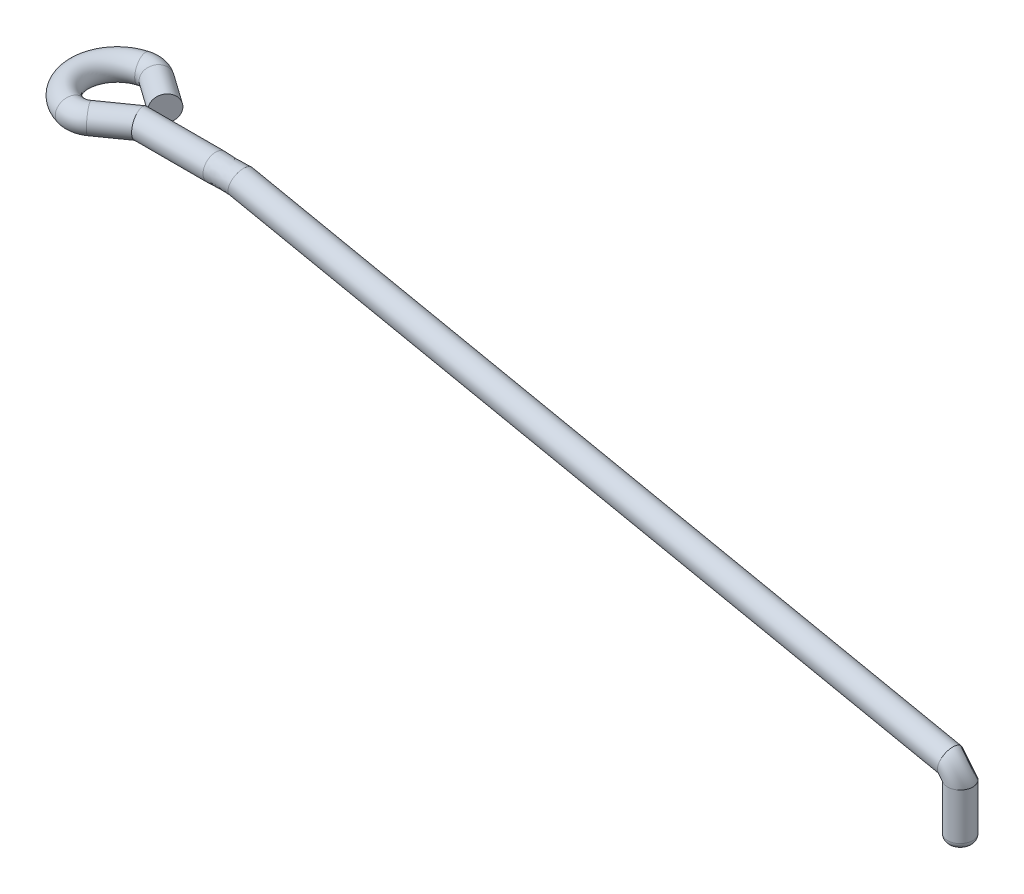
ISO-10303-21;
HEADER;
FILE_DESCRIPTION(('STEP AP214'),'2;1');
FILE_NAME('part.step','',(''),(''),'','','');
FILE_SCHEMA(('AUTOMOTIVE_DESIGN { 1 0 10303 214 1 1 1 1 }'));
ENDSEC;
DATA;
#1=APPLICATION_CONTEXT('core data for automotive mechanical design processes');
#2=APPLICATION_PROTOCOL_DEFINITION('international standard','automotive_design',2000,#1);
#3=PRODUCT_CONTEXT('',#1,'mechanical');
#4=PRODUCT('Part','Part','',(#3));
#5=PRODUCT_RELATED_PRODUCT_CATEGORY('part','',(#4));
#6=PRODUCT_DEFINITION_FORMATION('','',#4);
#7=PRODUCT_DEFINITION_CONTEXT('part definition',#1,'design');
#8=PRODUCT_DEFINITION('design','',#6,#7);
#9=PRODUCT_DEFINITION_SHAPE('','',#8);
#10=(LENGTH_UNIT() NAMED_UNIT(*) SI_UNIT(.MILLI.,.METRE.));
#11=(NAMED_UNIT(*) PLANE_ANGLE_UNIT() SI_UNIT($,.RADIAN.));
#12=(NAMED_UNIT(*) SI_UNIT($,.STERADIAN.) SOLID_ANGLE_UNIT());
#13=UNCERTAINTY_MEASURE_WITH_UNIT(LENGTH_MEASURE(1.E-05),#10,'distance_accuracy_value','');
#14=(GEOMETRIC_REPRESENTATION_CONTEXT(3) GLOBAL_UNCERTAINTY_ASSIGNED_CONTEXT((#13)) GLOBAL_UNIT_ASSIGNED_CONTEXT((#10,
#11,#12)) REPRESENTATION_CONTEXT('',''));
#15=CARTESIAN_POINT('',(0.,0.,0.));
#16=DIRECTION('',(0.,0.,1.));
#17=DIRECTION('',(1.,0.,0.));
#18=AXIS2_PLACEMENT_3D('',#15,#16,#17);
#19=CARTESIAN_POINT('',(1.4142135623731,5.9,-1.));
#20=DIRECTION('',(0.816496580927726,0.,0.577350269189625));
#21=DIRECTION('',(0.577350269189625,0.,-0.816496580927726));
#22=AXIS2_PLACEMENT_3D('',#19,#20,#21);
#23=PLANE('',#22);
#24=CARTESIAN_POINT('',(1.4142135623731,5.9,-1.));
#25=DIRECTION('',(0.816496580927726,0.,0.577350269189625));
#26=DIRECTION('',(0.577350269189625,0.,-0.816496580927726));
#27=AXIS2_PLACEMENT_3D('',#24,#25,#26);
#28=CIRCLE('',#27,0.5);
#29=CARTESIAN_POINT('',(1.70288869696791,5.9,-1.40824829046386));
#30=VERTEX_POINT('',#29);
#31=EDGE_CURVE('E197',#30,#30,#28,.T.);
#32=ORIENTED_EDGE('',*,*,#31,.T.);
#33=EDGE_LOOP('',(#32));
#34=FACE_BOUND('',#33,.T.);
#35=ADVANCED_FACE('F81',(#34),#23,.T.);
#36=CARTESIAN_POINT('',(1.13940307751542,5.9,0.));
#37=DIRECTION('',(1.,0.,0.));
#38=DIRECTION('',(0.,0.,-1.));
#39=AXIS2_PLACEMENT_3D('',#36,#37,#38);
#40=CYLINDRICAL_SURFACE('',#39,0.5);
#41=CARTESIAN_POINT('',(1.4142135623731,5.9,0.));
#42=DIRECTION('',(0.953020613871422,0.,-0.302905446527686));
#43=DIRECTION('',(-0.302905446527686,0.,-0.953020613871423));
#44=AXIS2_PLACEMENT_3D('',#41,#42,#43);
#45=ELLIPSE('',#44,0.52464762327529,0.5);
#46=CARTESIAN_POINT('',(1.2552949397752,5.9,-0.5));
#47=VERTEX_POINT('',#46);
#48=EDGE_CURVE('E160',#47,#47,#45,.T.);
#49=ORIENTED_EDGE('',*,*,#48,.T.);
#50=EDGE_LOOP('',(#49));
#51=FACE_BOUND('',#50,.T.);
#52=CARTESIAN_POINT('',(4.41406825310903,5.89999794507932,-0.499999999995777));
#53=CARTESIAN_POINT('',(4.41385680432195,5.91403478958151,-0.500000204530063));
#54=CARTESIAN_POINT('',(4.41349594539248,5.92806675225747,-0.499408878028171));
#55=CARTESIAN_POINT('',(4.41283419744527,5.95603634577255,-0.49704818020063));
#56=CARTESIAN_POINT('',(4.4125333196703,5.96997395845482,-0.495278588292289));
#57=CARTESIAN_POINT('',(4.41230322329716,5.99766966097721,-0.490569075816438));
#58=CARTESIAN_POINT('',(4.41237435105041,6.01142757155907,-0.487628066968662));
#59=CARTESIAN_POINT('',(4.41274488316283,6.03183363621175,-0.48235809799781));
#60=CARTESIAN_POINT('',(4.41291241406458,6.03859822941197,-0.480458001867672));
#61=CARTESIAN_POINT('',(4.41328633739765,6.05204231980902,-0.476374309013009));
#62=CARTESIAN_POINT('',(4.41349273958946,6.05872179518225,-0.474190641127162));
#63=CARTESIAN_POINT('',(4.41387847609348,6.07197945075633,-0.469544854634109));
#64=CARTESIAN_POINT('',(4.41405782908186,6.07855769800625,-0.467082930223386));
#65=CARTESIAN_POINT('',(4.41422897020896,6.09160708038217,-0.461883181564021));
#66=CARTESIAN_POINT('',(4.41422073362806,6.09807820127916,-0.459145321001232));
#67=CARTESIAN_POINT('',(4.41425355391734,6.11730836601295,-0.450526722659344));
#68=CARTESIAN_POINT('',(4.41435210635417,6.12988769757305,-0.444239746359988));
#69=CARTESIAN_POINT('',(4.41444289021472,6.15446777221667,-0.430631546377182));
#70=CARTESIAN_POINT('',(4.41443514777755,6.16646865681845,-0.423310577402524));
#71=CARTESIAN_POINT('',(4.41436461449508,6.1898131798165,-0.40768311585325));
#72=CARTESIAN_POINT('',(4.41430182389353,6.20115682112293,-0.399376627642818));
#73=CARTESIAN_POINT('',(4.41424734843857,6.21758967696694,-0.386245677706459));
#74=CARTESIAN_POINT('',(4.41423579046671,6.22295900389208,-0.38176742157918));
#75=CARTESIAN_POINT('',(4.41420953031541,6.2335053222589,-0.37258964804547));
#76=CARTESIAN_POINT('',(4.41419482827665,6.23868232229448,-0.367890140546723));
#77=CARTESIAN_POINT('',(4.41423229638961,6.24883461931487,-0.358278197375147));
#78=CARTESIAN_POINT('',(4.41428446609493,6.25380991764592,-0.353365763123923));
#79=CARTESIAN_POINT('',(4.41444518669802,6.26354947648329,-0.343337545076708));
#80=CARTESIAN_POINT('',(4.41455373985616,6.26831372852062,-0.338221753135854));
#81=CARTESIAN_POINT('',(4.41481052783372,6.28227963696056,-0.322579473992832));
#82=CARTESIAN_POINT('',(4.41488995798945,6.29115636319794,-0.311756267821232));
#83=CARTESIAN_POINT('',(4.41477582909689,6.30376366393444,-0.29499807107329));
#84=CARTESIAN_POINT('',(4.414698886194,6.30784853578004,-0.289324133010492));
#85=CARTESIAN_POINT('',(4.41451182672861,6.31577694749714,-0.277809945754446));
#86=CARTESIAN_POINT('',(4.41440170989421,6.3196204853903,-0.271969695198414));
#87=CARTESIAN_POINT('',(4.41424538859026,6.32707515056682,-0.260107837577543));
#88=CARTESIAN_POINT('',(4.41419945020532,6.33068525142367,-0.254085580617105));
#89=CARTESIAN_POINT('',(4.41424981049792,6.33764850865603,-0.241894742688693));
#90=CARTESIAN_POINT('',(4.41434611491288,6.34100165466145,-0.235726155828327));
#91=CARTESIAN_POINT('',(4.41453980188157,6.34744510452406,-0.223253534455629));
#92=CARTESIAN_POINT('',(4.4146371844097,6.35053541460844,-0.216949503156714));
#93=CARTESIAN_POINT('',(4.41477988363356,6.35644781663755,-0.204217231327569));
#94=CARTESIAN_POINT('',(4.41482520345505,6.35926992467538,-0.197788998277775));
#95=CARTESIAN_POINT('',(4.41483875575397,6.36732640629953,-0.17833377500987));
#96=CARTESIAN_POINT('',(4.41468464753742,6.37215221793903,-0.16513378143578));
#97=CARTESIAN_POINT('',(4.41440854155549,6.37854351124952,-0.145070536849216));
#98=CARTESIAN_POINT('',(4.41430899956088,6.38053291099992,-0.138338009661911));
#99=CARTESIAN_POINT('',(4.41420973391265,6.38422681096029,-0.124794426355444));
#100=CARTESIAN_POINT('',(4.41421000799192,6.38593131764012,-0.117983372023376));
#101=CARTESIAN_POINT('',(4.41422404075838,6.39061226937366,-0.0974506419461819));
#102=CARTESIAN_POINT('',(4.41425100728762,6.39315658986648,-0.08362800560085));
#103=CARTESIAN_POINT('',(4.41433175421164,6.39707288653285,-0.0558194184574624));
#104=CARTESIAN_POINT('',(4.4143855355368,6.39844482202435,-0.0418334620092248));
#105=CARTESIAN_POINT('',(4.41442100621867,6.40000683170554,-0.0137929270586643));
#106=CARTESIAN_POINT('',(4.41440269440972,6.40019688678554,0.000261652549541893));
#107=CARTESIAN_POINT('',(4.41432443131369,6.39959491532334,0.0213137048632645));
#108=CARTESIAN_POINT('',(4.41428987180468,6.39924633769738,0.0283267761900814));
#109=CARTESIAN_POINT('',(4.41424424967501,6.39825416554674,0.0423325899912424));
#110=CARTESIAN_POINT('',(4.41423318644785,6.39761057863744,0.0493253329856537));
#111=CARTESIAN_POINT('',(4.41420402526823,6.39642428296124,0.0597937402070872));
#112=CARTESIAN_POINT('',(4.41419219773162,6.39599164955969,0.0632822049431012));
#113=CARTESIAN_POINT('',(4.41411743521294,6.39505300300643,0.0702486777032698));
#114=CARTESIAN_POINT('',(4.41405450113614,6.39454699115465,0.0737266859115519));
#115=CARTESIAN_POINT('',(4.41383702983789,6.3929192218107,0.0841429641302459));
#116=CARTESIAN_POINT('',(4.41365382184159,6.3916877107884,0.091063661886433));
#117=CARTESIAN_POINT('',(4.41329322111489,6.38893419940053,0.10484618794073));
#118=CARTESIAN_POINT('',(4.41311582764868,6.38741223595807,0.111708023605817));
#119=CARTESIAN_POINT('',(4.41282275743837,6.38408029392157,0.125362144039997));
#120=CARTESIAN_POINT('',(4.4127070780549,6.38227032764899,0.132154431771293));
#121=CARTESIAN_POINT('',(4.4124927024311,6.3764128822485,0.15240795005278));
#122=CARTESIAN_POINT('',(4.41252653748885,6.37193712636716,0.165749489042744));
#123=CARTESIAN_POINT('',(4.41287471618924,6.36187791988191,0.192006656175508));
#124=CARTESIAN_POINT('',(4.41318912729818,6.35629420311285,0.204922181105903));
#125=CARTESIAN_POINT('',(4.41364317851813,6.34713315925475,0.223877031827622));
#126=CARTESIAN_POINT('',(4.41379129865186,6.34395630962022,0.230112487636336));
#127=CARTESIAN_POINT('',(4.41403806485193,6.33734348799947,0.242445092683774));
#128=CARTESIAN_POINT('',(4.41413671467717,6.33390753572354,0.248542252397064));
#129=CARTESIAN_POINT('',(4.41422663013009,6.32678146192389,0.260588820440647));
#130=CARTESIAN_POINT('',(4.41421789620065,6.32309134144851,0.26653822938021));
#131=CARTESIAN_POINT('',(4.41388618898977,6.31546877324177,0.278270851015932));
#132=CARTESIAN_POINT('',(4.41356320571789,6.31153631780995,0.284054058422281));
#133=CARTESIAN_POINT('',(4.41283173224613,6.30343642142418,0.295445237786194));
#134=CARTESIAN_POINT('',(4.41242324942362,6.29926900076692,0.301053224814747));
#135=CARTESIAN_POINT('',(4.41162755784314,6.29070233627657,0.312090548430559));
#136=CARTESIAN_POINT('',(4.41124034920846,6.28630309110041,0.317519883982514));
#137=CARTESIAN_POINT('',(4.41025828882755,6.27277086730354,0.33352175061397));
#138=CARTESIAN_POINT('',(4.4098417504668,6.26329442835076,0.343820761037185));
#139=CARTESIAN_POINT('',(4.40974653342478,6.2436586349694,0.363439736095406));
#140=CARTESIAN_POINT('',(4.41005686040876,6.23351168336198,0.372772087756247));
#141=CARTESIAN_POINT('',(4.41115113533055,6.21249114827082,0.390562925515077));
#142=CARTESIAN_POINT('',(4.41193563838287,6.20161672643298,0.399020373758199));
#143=CARTESIAN_POINT('',(4.41340422085778,6.17919331735784,0.415018748758139));
#144=CARTESIAN_POINT('',(4.41408829047473,6.16764426440783,0.422559586010947));
#145=CARTESIAN_POINT('',(4.41424654350923,6.14987640521557,0.433138884859199));
#146=CARTESIAN_POINT('',(4.41415470362703,6.14388034227289,0.436543030127802));
#147=CARTESIAN_POINT('',(4.41374979703011,6.13175785778489,0.443097977711023));
#148=CARTESIAN_POINT('',(4.41343664779525,6.12563138844131,0.446248685037396));
#149=CARTESIAN_POINT('',(4.41240062424566,6.10739063932756,0.455158299770862));
#150=CARTESIAN_POINT('',(4.4115707489995,6.09510549112428,0.46055841095848));
#151=CARTESIAN_POINT('',(4.41030397838897,6.07013126910403,0.470356251784528));
#152=CARTESIAN_POINT('',(4.40986675873587,6.05744253758617,0.474754806349011));
#153=CARTESIAN_POINT('',(4.40966880410122,6.03174535731762,0.482517548549082));
#154=CARTESIAN_POINT('',(4.40990803893298,6.01873692285931,0.485881782333668));
#155=CARTESIAN_POINT('',(4.41091356940082,5.99250398259878,0.49155224653742));
#156=CARTESIAN_POINT('',(4.4116804562486,5.97927925068715,0.493857285336727));
#157=CARTESIAN_POINT('',(4.41320126141871,5.95276621242335,0.497386380944726));
#158=CARTESIAN_POINT('',(4.41395523206627,5.93947891351747,0.498617523671656));
#159=CARTESIAN_POINT('',(4.41425624778608,5.91949480206681,0.49966431707872));
#160=CARTESIAN_POINT('',(4.41421832917332,5.9128255501792,0.499879955019301));
#161=CARTESIAN_POINT('',(4.41408012324639,5.89948413617414,0.500044277931896));
#162=CARTESIAN_POINT('',(4.4139798171956,5.89281197378437,0.499992882672548));
#163=CARTESIAN_POINT('',(4.41361340428231,5.87281198505698,0.499438266900454));
#164=CARTESIAN_POINT('',(4.41328176765358,5.85949391840603,0.498534968448869));
#165=CARTESIAN_POINT('',(4.4127714519409,5.83297213989116,0.495666445438085));
#166=CARTESIAN_POINT('',(4.41259276331642,5.81976842094538,0.493701287127462));
#167=CARTESIAN_POINT('',(4.41255290087818,5.79326795696335,0.488665592362753));
#168=CARTESIAN_POINT('',(4.41269882148288,5.77997558991762,0.485571617943947));
#169=CARTESIAN_POINT('',(4.41309755027861,5.7602661306082,0.480126015386486));
#170=CARTESIAN_POINT('',(4.41326049011067,5.75373308224158,0.478176190739951));
#171=CARTESIAN_POINT('',(4.4135981580353,5.7407523030182,0.474011196376262));
#172=CARTESIAN_POINT('',(4.41377288572132,5.73430456922815,0.471796035808387));
#173=CARTESIAN_POINT('',(4.41406134533506,5.72150143385842,0.467102517013943));
#174=CARTESIAN_POINT('',(4.41417505880275,5.71514606078793,0.46462407940355));
#175=CARTESIAN_POINT('',(4.41422183802293,5.70569272492055,0.460712832092293));
#176=CARTESIAN_POINT('',(4.41421679691335,5.70255479137506,0.459376767481895));
#177=CARTESIAN_POINT('',(4.41422306413485,5.69630689454409,0.456640728517482));
#178=CARTESIAN_POINT('',(4.41423437337381,5.69319693282145,0.45524075061876));
#179=CARTESIAN_POINT('',(4.41429465293574,5.67772336407033,0.448083722290742));
#180=CARTESIAN_POINT('',(4.41435486547393,5.66557535653422,0.441849616406106));
#181=CARTESIAN_POINT('',(4.41440497072758,5.6414911981543,0.428217494329396));
#182=CARTESIAN_POINT('',(4.4143927958644,5.62957113136557,0.42079121103174));
#183=CARTESIAN_POINT('',(4.41432666033925,5.60639471412474,0.404960248263663));
#184=CARTESIAN_POINT('',(4.41427269525326,5.59513843407853,0.396555465286886));
#185=CARTESIAN_POINT('',(4.41423324142099,5.57882248681074,0.383267778729499));
#186=CARTESIAN_POINT('',(4.41422699969248,5.57348070976493,0.378727183044381));
#187=CARTESIAN_POINT('',(4.41420774813968,5.56299269409734,0.369425512745677));
#188=CARTESIAN_POINT('',(4.41419473827248,5.55784645671533,0.364664436734628));
#189=CARTESIAN_POINT('',(4.41427369015496,5.54271902838968,0.350066474549422));
#190=CARTESIAN_POINT('',(4.4144834774415,5.53304263052995,0.33990956690775));
#191=CARTESIAN_POINT('',(4.41467356944041,5.5192470180399,0.324153130987077));
#192=CARTESIAN_POINT('',(4.41471626859253,5.5147907735011,0.318844587486059));
#193=CARTESIAN_POINT('',(4.41474290656789,5.50610335591227,0.308047781600515));
#194=CARTESIAN_POINT('',(4.4147268555365,5.50187214413004,0.302559550407912));
#195=CARTESIAN_POINT('',(4.41458864432837,5.48953564163592,0.285850412234956));
#196=CARTESIAN_POINT('',(4.41437662468027,5.48177520579677,0.274371033474505));
#197=CARTESIAN_POINT('',(4.41424072569296,5.4726964701388,0.259660542241462));
#198=CARTESIAN_POINT('',(4.41422002862491,5.47091639143382,0.256708279081848));
#199=CARTESIAN_POINT('',(4.41421021872544,5.46741761138713,0.25076754231798));
#200=CARTESIAN_POINT('',(4.41422110586346,5.46569890998606,0.247779068748759));
#201=CARTESIAN_POINT('',(4.41431891748322,5.45723696544141,0.232706489725716));
#202=CARTESIAN_POINT('',(4.41453611519897,5.4509615316864,0.220353953070632));
#203=CARTESIAN_POINT('',(4.41469499977165,5.44233167280044,0.201464053057537));
#204=CARTESIAN_POINT('',(4.414720103398,5.43958402459698,0.195102855634582));
#205=CARTESIAN_POINT('',(4.41471406878203,5.43435486908732,0.182270735612069));
#206=CARTESIAN_POINT('',(4.41468292114124,5.43187340632877,0.175799794855545));
#207=CARTESIAN_POINT('',(4.41451426977812,5.42478143069492,0.156088800624208));
#208=CARTESIAN_POINT('',(4.41430056692956,5.4205893911393,0.142695025714805));
#209=CARTESIAN_POINT('',(4.41420449363064,5.41515668397,0.122377283322066));
#210=CARTESIAN_POINT('',(4.41420991762262,5.41348797243412,0.115564802115182));
#211=CARTESIAN_POINT('',(4.4142206183244,5.41043845110933,0.101875703180792));
#212=CARTESIAN_POINT('',(4.4142258950352,5.40905763933526,0.0949990858958685));
#213=CARTESIAN_POINT('',(4.41425899703184,5.40534854237381,0.0742761405474154));
#214=CARTESIAN_POINT('',(4.41430411591301,5.40345688932737,0.0603490408229499));
#215=CARTESIAN_POINT('',(4.41437201697106,5.40085251467756,0.0323884221184512));
#216=CARTESIAN_POINT('',(4.41439480100002,5.40013969531781,0.0183549120596039));
#217=CARTESIAN_POINT('',(4.41434218900813,5.39989742323989,-0.00973889542842366));
#218=CARTESIAN_POINT('',(4.41426669266099,5.40036918021439,-0.0237992055772422));
#219=CARTESIAN_POINT('',(4.41424233673522,5.40196316226117,-0.0448191396052248));
#220=CARTESIAN_POINT('',(4.41424904009264,5.40264237273065,-0.0518150129941522));
#221=CARTESIAN_POINT('',(4.4141757256198,5.40429502444079,-0.0657718351880329));
#222=CARTESIAN_POINT('',(4.41409571125262,5.40526845393065,-0.0727327853764953));
#223=CARTESIAN_POINT('',(4.41385096322289,5.40750735299429,-0.0866045693336872));
#224=CARTESIAN_POINT('',(4.41368624485354,5.40877276982736,-0.0935154119209509));
#225=CARTESIAN_POINT('',(4.41337389492076,5.41159356979887,-0.107277744000009));
#226=CARTESIAN_POINT('',(4.41322626383614,5.41314896105971,-0.114129231823605));
#227=CARTESIAN_POINT('',(4.41286917008743,5.41824623376923,-0.134575225525628));
#228=CARTESIAN_POINT('',(4.41274532573765,5.42222008632108,-0.14806666253688));
#229=CARTESIAN_POINT('',(4.41280896294306,5.43128456608489,-0.174650794548581));
#230=CARTESIAN_POINT('',(4.41299612375661,5.43637403805324,-0.187743886187485));
#231=CARTESIAN_POINT('',(4.41347267488341,5.44763332647087,-0.213451193218981));
#232=CARTESIAN_POINT('',(4.41376205903041,5.45380307774492,-0.226065437445484));
#233=CARTESIAN_POINT('',(4.41420814860058,5.46718812773231,-0.250740119513353));
#234=CARTESIAN_POINT('',(4.41436485287229,5.47440343551889,-0.262800552547614));
#235=CARTESIAN_POINT('',(4.41382418828283,5.48595783442705,-0.28038978320626));
#236=CARTESIAN_POINT('',(4.41351447771796,5.48993246436618,-0.286170892234549));
#237=CARTESIAN_POINT('',(4.41282317135557,5.49811920491915,-0.29755841853876));
#238=CARTESIAN_POINT('',(4.41244155538655,5.50233138193872,-0.303164786279275));
#239=CARTESIAN_POINT('',(4.4113592385334,5.51518329375627,-0.319541220168044));
#240=CARTESIAN_POINT('',(4.41070739419089,5.52416068432813,-0.330054446640854));
#241=CARTESIAN_POINT('',(4.41002190062017,5.54295935676076,-0.35030352249302));
#242=CARTESIAN_POINT('',(4.40998770473054,5.55277988464988,-0.360040051702089));
#243=CARTESIAN_POINT('',(4.41053000547773,5.5731845490724,-0.378658841902707));
#244=CARTESIAN_POINT('',(4.4111065672104,5.58376876688945,-0.387541011724739));
#245=CARTESIAN_POINT('',(4.41212374348313,5.60015755444853,-0.400177651276557));
#246=CARTESIAN_POINT('',(4.41248824072628,5.60570654636567,-0.404275850675951));
#247=CARTESIAN_POINT('',(4.41317679363551,5.61697131172798,-0.412240618522132));
#248=CARTESIAN_POINT('',(4.41350085051391,5.62268708016722,-0.416107193910656));
#249=CARTESIAN_POINT('',(4.41399850689255,5.63415774370974,-0.423525151782307));
#250=CARTESIAN_POINT('',(4.41417512079986,5.63990930116689,-0.427081445600163));
#251=CARTESIAN_POINT('',(4.4142384116899,5.6515528571463,-0.433958195517649));
#252=CARTESIAN_POINT('',(4.41412512354583,5.65744483869206,-0.437278679934126));
#253=CARTESIAN_POINT('',(4.41370037087068,5.66935718817193,-0.443677436052388));
#254=CARTESIAN_POINT('',(4.413388729088,5.67537766627704,-0.446755488345988));
#255=CARTESIAN_POINT('',(4.41268566776741,5.68753494829591,-0.452663556099952));
#256=CARTESIAN_POINT('',(4.41229423309512,5.69367177407684,-0.4554935243602));
#257=CARTESIAN_POINT('',(4.41115199079292,5.712231479464,-0.46360010862859));
#258=CARTESIAN_POINT('',(4.41043188897012,5.72482275138109,-0.468503693548894));
#259=CARTESIAN_POINT('',(4.40960078806492,5.75036485436779,-0.47727477387002));
#260=CARTESIAN_POINT('',(4.4094889382841,5.76331515778802,-0.481143709117411));
#261=CARTESIAN_POINT('',(4.40989893215857,5.78647923641082,-0.487053904506305));
#262=CARTESIAN_POINT('',(4.41028167815901,5.79664138591453,-0.489310796552673));
#263=CARTESIAN_POINT('',(4.41129779655589,5.81707835337278,-0.493185852076871));
#264=CARTESIAN_POINT('',(4.41193132781882,5.82735323872355,-0.494803609377588));
#265=CARTESIAN_POINT('',(4.41316811830736,5.84799533905851,-0.497396986749066));
#266=CARTESIAN_POINT('',(4.41377136275968,5.85836259625181,-0.498372296204885));
#267=CARTESIAN_POINT('',(4.41429986294764,5.87915345399835,-0.499673672708511));
#268=CARTESIAN_POINT('',(4.41422523188818,5.88957704485332,-0.499999848150298));
#269=CARTESIAN_POINT('',(4.41406825310903,5.89999794507932,-0.499999999995777));
#270=B_SPLINE_CURVE_WITH_KNOTS('',3,(#52,#53,#54,#55,#56,#57,#58,#59,#60,#61,#62,#63,#64,#65,
#66,#67,#68,#69,#70,#71,#72,#73,#74,#75,#76,#77,#78,#79,#80,#81,#82,#83,#84,#85,#86,#87,#88,#89,
#90,#91,#92,#93,#94,#95,#96,#97,#98,#99,#100,#101,#102,#103,#104,#105,#106,#107,#108,#109,#110,
#111,#112,#113,#114,#115,#116,#117,#118,#119,#120,#121,#122,#123,#124,#125,#126,#127,#128,#129,
#130,#131,#132,#133,#134,#135,#136,#137,#138,#139,#140,#141,#142,#143,#144,#145,#146,#147,#148,
#149,#150,#151,#152,#153,#154,#155,#156,#157,#158,#159,#160,#161,#162,#163,#164,#165,#166,#167,
#168,#169,#170,#171,#172,#173,#174,#175,#176,#177,#178,#179,#180,#181,#182,#183,#184,#185,#186,
#187,#188,#189,#190,#191,#192,#193,#194,#195,#196,#197,#198,#199,#200,#201,#202,#203,#204,#205,
#206,#207,#208,#209,#210,#211,#212,#213,#214,#215,#216,#217,#218,#219,#220,#221,#222,#223,#224,
#225,#226,#227,#228,#229,#230,#231,#232,#233,#234,#235,#236,#237,#238,#239,#240,#241,#242,#243,
#244,#245,#246,#247,#248,#249,#250,#251,#252,#253,#254,#255,#256,#257,#258,#259,#260,#261,#262,
#263,#264,#265,#266,#267,#268,#269),.UNSPECIFIED.,.T.,.F.,(4,2,2,2,2,2,2,2,2,2,2,2,2,2,2,2,2,2,
2,2,2,2,2,2,2,2,2,2,2,2,2,2,2,2,2,2,2,2,2,2,2,2,2,2,2,2,2,2,2,2,2,2,2,2,2,2,2,2,2,2,2,2,2,2,2,2,
2,2,2,2,2,2,2,2,2,2,2,2,2,2,2,2,2,2,2,2,2,2,2,2,2,2,2,2,2,2,2,2,2,2,2,2,2,2,2,2,2,2,4),(0.,
0.0420992741473111,0.0842064319031292,0.126352800013496,0.147432569953566,0.168517640046359,
0.189588084595017,0.210661305716521,0.252796703707913,0.294921740312176,0.337046590380767,
0.358016836710111,0.378986144878872,0.399955313067732,0.420925321959686,0.462857438834244,
0.483828028618825,0.504798790288149,0.525856241527043,0.546914542148627,0.567972343712671,
0.589028880934358,0.631133609604535,0.652191516838889,0.673248945786774,0.715359430565743,
0.75747137653034,0.799584003396627,0.820644470687122,0.841704394352818,0.852249203469453,
0.862793825803704,0.883882545132891,0.904968585389906,0.926053723777205,0.968212856026111,
1.01038212844035,1.03137579582414,1.05236786779877,1.07335985319544,1.09435250598022,
1.11534334815436,1.1363343119511,1.17826979535591,1.21957508094009,1.26092881623675,
1.30228658634958,1.32296145915001,1.34364404510875,1.38393259554953,1.42418784156103,
1.46444129121594,1.50473991675967,1.54477058243471,1.56478006426304,1.58479555838057,
1.62480636090924,1.66481466748455,1.70570593649229,1.72616056297039,1.74661448433765,
1.76707459061296,1.77730536288293,1.78753670325495,1.82844778701331,1.87053290977965,
1.91262248839051,1.93364960396969,1.95467685284253,1.99670631436135,2.01749471973317,
2.03827953538907,2.07979341055732,2.09013536892879,2.10047731729549,2.1419874902137,
2.16277043363362,2.18355684978838,2.22560472926894,2.24664114811567,2.26767742190407,
2.30978811041078,2.35189530665677,2.39404552037412,2.41512658789382,2.43620681356991,
2.4572832345708,2.47836024602655,2.52049790074111,2.56259212558457,2.60468381168064,
2.64677586306536,2.66783409255975,2.68889823829743,2.73035987301837,2.77178480953655,
2.81321416165712,2.83393349646117,2.85465220999869,2.8749361770629,2.89521770422166,
2.91551738073292,2.93582091108724,2.97636277250386,3.01684791765534,3.04807257263634,
3.07931703942889,3.11057660143708,3.14183094320935),.UNSPECIFIED.);
#271=CARTESIAN_POINT('',(4.41421356237311,5.46819659455404,0.252082960640474));
#272=VERTEX_POINT('',#271);
#273=EDGE_CURVE('E100',#272,#272,#270,.F.);
#274=ORIENTED_EDGE('',*,*,#273,.T.);
#275=EDGE_LOOP('',(#274));
#276=FACE_BOUND('',#275,.T.);
#277=ADVANCED_FACE('F162',(#51,#276),#40,.T.);
#278=CARTESIAN_POINT('',(1.4142135623731,5.9,-1.));
#279=DIRECTION('',(-0.816496580927726,0.,-0.577350269189626));
#280=DIRECTION('',(-0.577350269189625,0.,0.816496580927726));
#281=AXIS2_PLACEMENT_3D('',#278,#279,#280);
#282=CYLINDRICAL_SURFACE('',#281,0.5);
#283=CARTESIAN_POINT('',(0.233034137605852,5.9,-1.83521998105094));
#284=DIRECTION('',(0.816496580927726,0.,0.577350269189625));
#285=DIRECTION('',(0.577350269189625,0.,-0.816496580927726));
#286=AXIS2_PLACEMENT_3D('',#283,#284,#285);
#287=CIRCLE('',#286,0.5);
#288=CARTESIAN_POINT('',(0.521709272200665,5.9,-2.2434682715148));
#289=VERTEX_POINT('',#288);
#290=EDGE_CURVE('E195',#289,#289,#287,.T.);
#291=ORIENTED_EDGE('',*,*,#290,.T.);
#292=EDGE_LOOP('',(#291));
#293=FACE_BOUND('',#292,.T.);
#294=ORIENTED_EDGE('',*,*,#31,.F.);
#295=EDGE_LOOP('',(#294));
#296=FACE_BOUND('',#295,.T.);
#297=ADVANCED_FACE('F166',(#293,#296),#282,.T.);
#298=CARTESIAN_POINT('',(-0.199978564286367,5.9,-1.22284754535515));
#299=DIRECTION('',(0.,1.,0.));
#300=DIRECTION('',(0.,0.,1.));
#301=AXIS2_PLACEMENT_3D('',#298,#299,#300);
#302=TOROIDAL_SURFACE('',#301,0.75,0.5);
#303=CARTESIAN_POINT('',(-0.399957128572734,5.9,-1.9456950907103));
#304=DIRECTION('',(0.963796727140198,0.,-0.266638085715156));
#305=DIRECTION('',(-0.266638085715156,0.,-0.963796727140198));
#306=AXIS2_PLACEMENT_3D('',#303,#304,#305);
#307=CIRCLE('',#306,0.5);
#308=CARTESIAN_POINT('',(-0.533276171430312,5.9,-2.42759345428039));
#309=VERTEX_POINT('',#308);
#310=EDGE_CURVE('E190',#309,#309,#307,.T.);
#311=CARTESIAN_POINT('',(-0.199978564286367,5.9,-1.22284754535515));
#312=DIRECTION('',(0.,1.,0.));
#313=DIRECTION('',(0.,0.,1.));
#314=AXIS2_PLACEMENT_3D('',#311,#312,#313);
#315=CIRCLE('',#314,1.25);
#316=EDGE_CURVE('',#289,#309,#315,.T.);
#317=ORIENTED_EDGE('',*,*,#290,.F.);
#318=ORIENTED_EDGE('',*,*,#310,.T.);
#319=ORIENTED_EDGE('',*,*,#316,.T.);
#320=ORIENTED_EDGE('',*,*,#316,.F.);
#321=EDGE_LOOP('',(#317,#319,#318,#320));
#322=FACE_BOUND('',#321,.T.);
#323=ADVANCED_FACE('F247',(#322),#302,.T.);
#324=CARTESIAN_POINT('',(0.,5.9,-0.499999999999999));
#325=DIRECTION('',(0.,1.,0.));
#326=DIRECTION('',(0.,0.,1.));
#327=AXIS2_PLACEMENT_3D('',#324,#325,#326);
#328=TOROIDAL_SURFACE('',#327,1.5,0.5);
#329=CARTESIAN_POINT('',(-0.399957128572734,5.9,0.945695090710298));
#330=DIRECTION('',(-0.963796727140198,0.,-0.266638085715156));
#331=DIRECTION('',(-0.266638085715156,0.,0.963796727140198));
#332=AXIS2_PLACEMENT_3D('',#329,#330,#331);
#333=CIRCLE('',#332,0.5);
#334=CARTESIAN_POINT('',(-0.533276171430312,5.9,1.4275934542804));
#335=VERTEX_POINT('',#334);
#336=EDGE_CURVE('E188',#335,#335,#333,.T.);
#337=CARTESIAN_POINT('',(0.,5.9,-0.499999999999999));
#338=DIRECTION('',(0.,1.,0.));
#339=DIRECTION('',(0.,0.,1.));
#340=AXIS2_PLACEMENT_3D('',#337,#338,#339);
#341=CIRCLE('',#340,2.);
#342=EDGE_CURVE('',#309,#335,#341,.T.);
#343=ORIENTED_EDGE('',*,*,#310,.F.);
#344=ORIENTED_EDGE('',*,*,#336,.T.);
#345=ORIENTED_EDGE('',*,*,#342,.T.);
#346=ORIENTED_EDGE('',*,*,#342,.F.);
#347=EDGE_LOOP('',(#343,#345,#344,#346));
#348=FACE_BOUND('',#347,.T.);
#349=ADVANCED_FACE('F180',(#348),#328,.T.);
#350=CARTESIAN_POINT('',(-0.199978564286367,5.9,0.222847545355149));
#351=DIRECTION('',(0.,1.,0.));
#352=DIRECTION('',(0.,0.,1.));
#353=AXIS2_PLACEMENT_3D('',#350,#351,#352);
#354=TOROIDAL_SURFACE('',#353,0.75,0.5);
#355=CARTESIAN_POINT('',(0.233034137605853,5.9,0.835219981050944));
#356=DIRECTION('',(-0.816496580927726,0.,0.577350269189626));
#357=DIRECTION('',(0.577350269189626,0.,0.816496580927726));
#358=AXIS2_PLACEMENT_3D('',#355,#356,#357);
#359=CIRCLE('',#358,0.5);
#360=CARTESIAN_POINT('',(0.521709272200666,5.9,1.24346827151481));
#361=VERTEX_POINT('',#360);
#362=EDGE_CURVE('E185',#361,#361,#359,.T.);
#363=CARTESIAN_POINT('',(-0.199978564286367,5.9,0.222847545355149));
#364=DIRECTION('',(0.,1.,0.));
#365=DIRECTION('',(0.,0.,1.));
#366=AXIS2_PLACEMENT_3D('',#363,#364,#365);
#367=CIRCLE('',#366,1.25);
#368=EDGE_CURVE('',#335,#361,#367,.T.);
#369=ORIENTED_EDGE('',*,*,#336,.F.);
#370=ORIENTED_EDGE('',*,*,#362,.T.);
#371=ORIENTED_EDGE('',*,*,#368,.T.);
#372=ORIENTED_EDGE('',*,*,#368,.F.);
#373=EDGE_LOOP('',(#369,#371,#370,#372));
#374=FACE_BOUND('',#373,.T.);
#375=ADVANCED_FACE('F142',(#374),#354,.T.);
#376=CARTESIAN_POINT('',(0.233034137605853,5.9,0.835219981050944));
#377=DIRECTION('',(0.816496580927726,0.,-0.577350269189626));
#378=DIRECTION('',(-0.577350269189626,0.,-0.816496580927726));
#379=AXIS2_PLACEMENT_3D('',#376,#377,#378);
#380=CYLINDRICAL_SURFACE('',#379,0.5);
#381=ORIENTED_EDGE('',*,*,#362,.F.);
#382=EDGE_LOOP('',(#381));
#383=FACE_BOUND('',#382,.T.);
#384=ORIENTED_EDGE('',*,*,#48,.F.);
#385=EDGE_LOOP('',(#384));
#386=FACE_BOUND('',#385,.T.);
#387=ADVANCED_FACE('F140',(#383,#386),#380,.T.);
#388=CARTESIAN_POINT('',(4.40396350537233,5.46883332358008,0.254440421543055));
#389=CARTESIAN_POINT('',(4.4142135623731,5.46819659455404,0.252082960640477));
#390=CARTESIAN_POINT('',(5.31356020098893,5.41232957749881,0.0452378144872572));
#391=CARTESIAN_POINT('',(4.4039721902291,5.44762906820409,0.21851962776548));
#392=CARTESIAN_POINT('',(4.41421356237309,5.44718968116733,0.21609934351998));
#393=CARTESIAN_POINT('',(5.31279818603236,5.40863757803936,0.00374203657783068));
#394=CARTESIAN_POINT('',(4.403970389892,5.42801197017716,0.175307696239318));
#395=CARTESIAN_POINT('',(4.4142135623731,5.42780226858614,0.172840235165451));
#396=CARTESIAN_POINT('',(5.31295614877552,5.40940291519884,-0.0436563972467835));
#397=CARTESIAN_POINT('',(4.40392320956058,5.40165541496995,0.071830178938046));
#398=CARTESIAN_POINT('',(4.41421356237309,5.40196873499894,0.069349142214526));
#399=CARTESIAN_POINT('',(5.31709578160493,5.42945963723135,-0.148338626489029));
#400=CARTESIAN_POINT('',(4.40387725943006,5.39504413292463,0.0112564717946468));
#401=CARTESIAN_POINT('',(4.4142135623731,5.39565207595825,0.00880999201027765));
#402=CARTESIAN_POINT('',(5.32112747581214,5.44899339139898,-0.205845728475019));
#403=CARTESIAN_POINT('',(4.40371594560427,5.40974790738928,-0.121411227722833));
#404=CARTESIAN_POINT('',(4.41421356237309,5.41096292255963,-0.123641341520671));
#405=CARTESIAN_POINT('',(5.33528125534478,5.51756914038296,-0.319312970241112));
#406=CARTESIAN_POINT('',(4.40359922242381,5.4316883490513,-0.193565368722289));
#407=CARTESIAN_POINT('',(4.4142135623731,5.43321527856466,-0.195610592848269));
#408=CARTESIAN_POINT('',(5.34552262278197,5.56718906282172,-0.375059882035553));
#409=CARTESIAN_POINT('',(4.40329705327885,5.51347642988551,-0.327636926291709));
#410=CARTESIAN_POINT('',(4.41421356237309,5.51552923282654,-0.329140865571219));
#411=CARTESIAN_POINT('',(5.37203513922823,5.69564349215339,-0.46109747182312));
#412=CARTESIAN_POINT('',(4.40311174938732,5.5736878227515,-0.388642788407053));
#413=CARTESIAN_POINT('',(4.41421356237309,5.57594980511853,-0.389789578672551));
#414=CARTESIAN_POINT('',(5.38829382266356,5.77441760273633,-0.490409699165242));
#415=CARTESIAN_POINT('',(4.40272935968084,5.71741004822481,-0.473456262254737));
#416=CARTESIAN_POINT('',(4.41421356237309,5.71988427360052,-0.473817232219377));
#417=CARTESIAN_POINT('',(5.42184494312495,5.93697441023672,-0.505488970660995));
#418=CARTESIAN_POINT('',(4.40253492016143,5.7999262633548,-0.496676929531386));
#419=CARTESIAN_POINT('',(4.4142135623731,5.80240208350344,-0.496614666411951));
#420=CARTESIAN_POINT('',(5.43890519246615,6.01963214654864,-0.491151659994585));
#421=CARTESIAN_POINT('',(4.4022019783752,5.95684637707833,-0.503472041328363));
#422=CARTESIAN_POINT('',(4.4142135623731,5.95914883813898,-0.502645894389611));
#423=CARTESIAN_POINT('',(5.46811772038483,6.16116826254635,-0.430159227016572));
#424=CARTESIAN_POINT('',(4.40206402207226,6.03062792143397,-0.487805434744832));
#425=CARTESIAN_POINT('',(4.4142135623731,6.03275982640182,-0.486640804842958));
#426=CARTESIAN_POINT('',(5.48022209573798,6.21981454878466,-0.384455423102762));
#427=CARTESIAN_POINT('',(4.40185824177982,6.15389748342369,-0.43655867012113));
#428=CARTESIAN_POINT('',(4.4142135623731,6.15562606954315,-0.434856018716962));
#429=CARTESIAN_POINT('',(5.49827739184826,6.30729333500107,-0.285464281972591));
#430=CARTESIAN_POINT('',(4.40178916908664,6.20374041089139,-0.401496855911115));
#431=CARTESIAN_POINT('',(4.4142135623731,6.20523821670322,-0.3995923866996));
#432=CARTESIAN_POINT('',(5.50433787467585,6.33665666852955,-0.232493024852524));
#433=CARTESIAN_POINT('',(4.40169930094724,6.28160701170823,-0.328416487636852));
#434=CARTESIAN_POINT('',(4.4142135623731,6.28265786379436,-0.326216804779857));
#435=CARTESIAN_POINT('',(5.51222296341979,6.37486030630518,-0.133215206514356));
#436=CARTESIAN_POINT('',(4.40167785199019,6.30996242104394,-0.29036121532063));
#437=CARTESIAN_POINT('',(4.41421356237309,6.31079649205926,-0.288066577760974));
#438=CARTESIAN_POINT('',(5.51410490880069,6.38397842304173,-0.0867335923966838));
#439=CARTESIAN_POINT('',(4.40166048227666,6.35237093179591,-0.21851962776548));
#440=CARTESIAN_POINT('',(4.4142135623731,6.35281031883267,-0.21609934351998));
#441=CARTESIAN_POINT('',(5.51562893871383,6.39136242196065,-0.00374203657783072));
#442=CARTESIAN_POINT('',(4.40166228261376,6.37198802982284,-0.175307696239318));
#443=CARTESIAN_POINT('',(4.41421356237309,6.37219773141386,-0.172840235165451));
#444=CARTESIAN_POINT('',(5.51547097597067,6.39059708480117,0.0436563972467835));
#445=CARTESIAN_POINT('',(4.40170946294517,6.39834458503005,-0.0718301789380461));
#446=CARTESIAN_POINT('',(4.4142135623731,6.39803126500106,-0.0693491422145261));
#447=CARTESIAN_POINT('',(5.51133134314126,6.37054036276866,0.148338626489029));
#448=CARTESIAN_POINT('',(4.4017554130757,6.40495586707538,-0.011256471794647));
#449=CARTESIAN_POINT('',(4.41421356237309,6.40434792404175,-0.00880999201027785));
#450=CARTESIAN_POINT('',(5.50729964893405,6.35100660860103,0.205845728475019));
#451=CARTESIAN_POINT('',(4.40191672690149,6.39025209261072,0.121411227722833));
#452=CARTESIAN_POINT('',(4.41421356237309,6.38903707744037,0.123641341520671));
#453=CARTESIAN_POINT('',(5.49314586940141,6.28243085961705,0.319312970241112));
#454=CARTESIAN_POINT('',(4.40203345008195,6.36831165094871,0.193565368722289));
#455=CARTESIAN_POINT('',(4.4142135623731,6.36678472143535,0.195610592848268));
#456=CARTESIAN_POINT('',(5.48290450196422,6.23281093717829,0.375059882035553));
#457=CARTESIAN_POINT('',(4.4023356192269,6.28652357011449,0.327636926291709));
#458=CARTESIAN_POINT('',(4.4142135623731,6.28447076717347,0.329140865571219));
#459=CARTESIAN_POINT('',(5.45639198551796,6.10435650784662,0.46109747182312));
#460=CARTESIAN_POINT('',(4.40252092311843,6.2263121772485,0.388642788407052));
#461=CARTESIAN_POINT('',(4.4142135623731,6.22405019488147,0.389789578672551));
#462=CARTESIAN_POINT('',(5.44013330208263,6.02558239726368,0.490409699165242));
#463=CARTESIAN_POINT('',(4.40290331282492,6.0825899517752,0.473456262254737));
#464=CARTESIAN_POINT('',(4.4142135623731,6.08011572639949,0.473817232219377));
#465=CARTESIAN_POINT('',(5.40658218162124,5.86302558976328,0.505488970660995));
#466=CARTESIAN_POINT('',(4.40309775234433,6.0000737366452,0.496676929531386));
#467=CARTESIAN_POINT('',(4.4142135623731,5.99759791649656,0.496614666411951));
#468=CARTESIAN_POINT('',(5.38952193228004,5.78036785345136,0.491151659994585));
#469=CARTESIAN_POINT('',(4.40343069413056,5.84315362292167,0.503472041328363));
#470=CARTESIAN_POINT('',(4.4142135623731,5.84085116186102,0.502645894389611));
#471=CARTESIAN_POINT('',(5.36030940436137,5.63883173745366,0.430159227016572));
#472=CARTESIAN_POINT('',(4.4035686504335,5.76937207856603,0.487805434744832));
#473=CARTESIAN_POINT('',(4.41421356237309,5.76724017359818,0.486640804842958));
#474=CARTESIAN_POINT('',(5.34820502900821,5.58018545121534,0.384455423102762));
#475=CARTESIAN_POINT('',(4.40377443072594,5.64610251657631,0.43655867012113));
#476=CARTESIAN_POINT('',(4.4142135623731,5.64437393045686,0.434856018716962));
#477=CARTESIAN_POINT('',(5.33014973289793,5.49270666499894,0.285464281972592));
#478=CARTESIAN_POINT('',(4.40384350341912,5.59625958910861,0.401496855911115));
#479=CARTESIAN_POINT('',(4.41421356237309,5.59476178329678,0.3995923866996));
#480=CARTESIAN_POINT('',(5.32408925007035,5.46334333147045,0.232493024852524));
#481=CARTESIAN_POINT('',(4.40393337155851,5.51839298829177,0.328416487636853));
#482=CARTESIAN_POINT('',(4.4142135623731,5.51734213620564,0.326216804779857));
#483=CARTESIAN_POINT('',(5.3162041613264,5.42513969369482,0.133215206514357));
#484=CARTESIAN_POINT('',(4.40395482051557,5.49003757895607,0.29036121532063));
#485=CARTESIAN_POINT('',(4.4142135623731,5.48920350794074,0.288066577760974));
#486=CARTESIAN_POINT('',(5.3143222159455,5.41602157695827,0.0867335923966838));
#487=CARTESIAN_POINT('',(4.40396350537233,5.46883332358008,0.254440421543055));
#488=CARTESIAN_POINT('',(4.4142135623731,5.46819659455404,0.252082960640477));
#489=CARTESIAN_POINT('',(5.31356020098893,5.41232957749881,0.0452378144872572));
#490=B_SPLINE_SURFACE_WITH_KNOTS('',3,1,((#388,#389,#390),(#391,#392,#393),(#394,#395,#396),
(#397,#398,#399),(#400,#401,#402),(#403,#404,#405),(#406,#407,#408),(#409,#410,#411),(#412,#413,
#414),(#415,#416,#417),(#418,#419,#420),(#421,#422,#423),(#424,#425,#426),(#427,#428,#429),
(#430,#431,#432),(#433,#434,#435),(#436,#437,#438),(#439,#440,#441),(#442,#443,#444),(#445,#446,
#447),(#448,#449,#450),(#451,#452,#453),(#454,#455,#456),(#457,#458,#459),(#460,#461,#462),
(#463,#464,#465),(#466,#467,#468),(#469,#470,#471),(#472,#473,#474),(#475,#476,#477),(#478,#479,
#480),(#481,#482,#483),(#484,#485,#486),(#487,#488,#489)),.UNSPECIFIED.,.T.,.F.,.F.,(4,2,2,2,2,
2,2,2,2,2,2,2,2,2,2,2,4),(2,1,2),(0.,0.0625,0.125,0.1875,0.25,0.3125,0.375,0.4375,0.5,0.5625,
0.625,0.6875,0.75,0.8125,0.875,0.9375,1.),(-0.0113972261202175,0.,1.),.UNSPECIFIED.);
#491=CARTESIAN_POINT('',(5.41421356237309,5.9,0.));
#492=DIRECTION('',(-0.979357513523489,0.202135748211665,0.));
#493=DIRECTION('',(0.,0.,1.));
#494=AXIS2_PLACEMENT_3D('',#491,#492,#493);
#495=CIRCLE('',#494,0.5);
#496=CARTESIAN_POINT('',(5.31356020098893,5.41232957749881,0.0452378144872572));
#497=VERTEX_POINT('',#496);
#498=EDGE_CURVE('E98',#497,#497,#495,.T.);
#499=CARTESIAN_POINT('',(4.41421356237311,5.46819659455404,0.252082960640474));
#500=CARTESIAN_POINT('',(4.42358175652536,5.46761464645971,0.249928323701378));
#501=CARTESIAN_POINT('',(4.43294995067761,5.46703269836538,0.247773686762282));
#502=CARTESIAN_POINT('',(4.4516863389821,5.46586880217673,0.24346441288409));
#503=CARTESIAN_POINT('',(4.46105453313435,5.46528685408241,0.241309775944994));
#504=CARTESIAN_POINT('',(4.47979092143885,5.46412295789376,0.237000502066802));
#505=CARTESIAN_POINT('',(4.4891591155911,5.46354100979943,0.234845865127706));
#506=CARTESIAN_POINT('',(4.50789550389559,5.46237711361078,0.230536591249514));
#507=CARTESIAN_POINT('',(4.51726369804784,5.46179516551646,0.228381954310418));
#508=CARTESIAN_POINT('',(4.53600008635234,5.46063126932781,0.224072680432226));
#509=CARTESIAN_POINT('',(4.54536828050458,5.46004932123348,0.22191804349313));
#510=CARTESIAN_POINT('',(4.56410466880908,5.45888542504483,0.217608769614938));
#511=CARTESIAN_POINT('',(4.57347286296133,5.45830347695051,0.215454132675842));
#512=CARTESIAN_POINT('',(4.59220925126583,5.45713958076186,0.21114485879765));
#513=CARTESIAN_POINT('',(4.60157744541807,5.45655763266753,0.208990221858554));
#514=CARTESIAN_POINT('',(4.62031383372257,5.45539373647888,0.204680947980362));
#515=CARTESIAN_POINT('',(4.62968202787482,5.45481178838455,0.202526311041265));
#516=CARTESIAN_POINT('',(4.64841841617931,5.4536478921959,0.198217037163073));
#517=CARTESIAN_POINT('',(4.65778661033156,5.45306594410158,0.196062400223978));
#518=CARTESIAN_POINT('',(4.67652299863606,5.45190204791293,0.191753126345786));
#519=CARTESIAN_POINT('',(4.68589119278831,5.4513200998186,0.189598489406689));
#520=CARTESIAN_POINT('',(4.7046275810928,5.45015620362995,0.185289215528497));
#521=CARTESIAN_POINT('',(4.71399577524505,5.44957425553563,0.183134578589402));
#522=CARTESIAN_POINT('',(4.73273216354955,5.44841035934698,0.17882530471121));
#523=CARTESIAN_POINT('',(4.7421003577018,5.44782841125265,0.176670667772114));
#524=CARTESIAN_POINT('',(4.76083674600629,5.446664515064,0.172361393893921));
#525=CARTESIAN_POINT('',(4.77020494015854,5.44608256696968,0.170206756954826));
#526=CARTESIAN_POINT('',(4.78894132846304,5.44491867078103,0.165897483076634));
#527=CARTESIAN_POINT('',(4.79830952261528,5.4443367226867,0.163742846137537));
#528=CARTESIAN_POINT('',(4.81704591091978,5.44317282649805,0.159433572259345));
#529=CARTESIAN_POINT('',(4.82641410507203,5.44259087840373,0.15727893532025));
#530=CARTESIAN_POINT('',(4.84515049337653,5.44142698221508,0.152969661442058));
#531=CARTESIAN_POINT('',(4.85451868752877,5.44084503412075,0.150815024502961));
#532=CARTESIAN_POINT('',(4.87325507583327,5.4396811379321,0.146505750624769));
#533=CARTESIAN_POINT('',(4.88262326998552,5.43909918983777,0.144351113685673));
#534=CARTESIAN_POINT('',(4.90135965829001,5.43793529364912,0.140041839807481));
#535=CARTESIAN_POINT('',(4.91072785244226,5.4373533455548,0.137887202868385));
#536=CARTESIAN_POINT('',(4.92946424074676,5.43618944936615,0.133577928990193));
#537=CARTESIAN_POINT('',(4.93883243489901,5.43560750127182,0.131423292051097));
#538=CARTESIAN_POINT('',(4.9575688232035,5.43444360508317,0.127114018172905));
#539=CARTESIAN_POINT('',(4.96693701735575,5.43386165698885,0.124959381233809));
#540=CARTESIAN_POINT('',(4.98567340566025,5.4326977608002,0.120650107355617));
#541=CARTESIAN_POINT('',(4.99504159981249,5.43211581270587,0.118495470416521));
#542=CARTESIAN_POINT('',(5.01377798811699,5.43095191651722,0.114186196538329));
#543=CARTESIAN_POINT('',(5.02314618226924,5.4303699684229,0.112031559599233));
#544=CARTESIAN_POINT('',(5.04188257057374,5.42920607223425,0.107722285721041));
#545=CARTESIAN_POINT('',(5.05125076472598,5.42862412413992,0.105567648781945));
#546=CARTESIAN_POINT('',(5.06998715303048,5.42746022795127,0.101258374903753));
#547=CARTESIAN_POINT('',(5.07935534718273,5.42687827985695,0.0991037379646574));
#548=CARTESIAN_POINT('',(5.09809173548723,5.42571438366829,0.0947944640864654));
#549=CARTESIAN_POINT('',(5.10745992963947,5.42513243557397,0.0926398271473693));
#550=CARTESIAN_POINT('',(5.12619631794397,5.42396853938532,0.0883305532691773));
#551=CARTESIAN_POINT('',(5.13556451209622,5.42338659129099,0.0861759163300813));
#552=CARTESIAN_POINT('',(5.15430090040071,5.42222269510234,0.0818666424518893));
#553=CARTESIAN_POINT('',(5.16366909455296,5.42164074700802,0.0797120055127933));
#554=CARTESIAN_POINT('',(5.18240548285746,5.42047685081937,0.0754027316346013));
#555=CARTESIAN_POINT('',(5.1917736770097,5.41989490272504,0.0732480946955052));
#556=CARTESIAN_POINT('',(5.2105100653142,5.41873100653639,0.0689388208173132));
#557=CARTESIAN_POINT('',(5.21987825946645,5.41814905844207,0.0667841838782173));
#558=CARTESIAN_POINT('',(5.23861464777095,5.41698516225342,0.0624749100000253));
#559=CARTESIAN_POINT('',(5.24798284192319,5.41640321415909,0.0603202730609293));
#560=CARTESIAN_POINT('',(5.26671923022769,5.41523931797044,0.0560109991827372));
#561=CARTESIAN_POINT('',(5.27608742437994,5.41465736987612,0.0538563622436412));
#562=CARTESIAN_POINT('',(5.29482381268444,5.41349347368747,0.0495470883654493));
#563=CARTESIAN_POINT('',(5.30419200683668,5.41291152559314,0.0473924514263533));
#564=CARTESIAN_POINT('',(5.31356020098893,5.41232957749881,0.0452378144872572));
#565=B_SPLINE_CURVE_WITH_KNOTS('',3,(#499,#500,#501,#502,#503,#504,#505,#506,#507,#508,#509,
#510,#511,#512,#513,#514,#515,#516,#517,#518,#519,#520,#521,#522,#523,#524,#525,#526,#527,#528,
#529,#530,#531,#532,#533,#534,#535,#536,#537,#538,#539,#540,#541,#542,#543,#544,#545,#546,#547,
#548,#549,#550,#551,#552,#553,#554,#555,#556,#557,#558,#559,#560,#561,#562,#563,#564),
.UNSPECIFIED.,.F.,.F.,(4,2,2,2,2,2,2,2,2,2,2,2,2,2,2,2,2,2,2,2,2,2,2,2,2,2,2,2,2,2,2,2,4),(0.,
0.0288911348060646,0.0577822696121301,0.0866734044181939,0.115564539224259,0.144455674030323,
0.173346808836388,0.202237943642452,0.231129078448516,0.260020213254582,0.288911348060645,
0.317802482866711,0.346693617672776,0.37558475247884,0.404475887284904,0.43336702209097,
0.462258156897033,0.491149291703098,0.520040426509163,0.548931561315227,0.577822696121292,
0.606713830927356,0.635604965733421,0.664496100539485,0.69338723534555,0.722278370151614,
0.751169504957679,0.780060639763744,0.808951774569807,0.837842909375873,0.866734044181938,
0.895625178988002,0.924516313794066),.UNSPECIFIED.);
#566=EDGE_CURVE('BSEAM131',#272,#497,#565,.T.);
#567=ORIENTED_EDGE('',*,*,#273,.F.);
#568=ORIENTED_EDGE('',*,*,#498,.T.);
#569=ORIENTED_EDGE('',*,*,#566,.T.);
#570=ORIENTED_EDGE('',*,*,#566,.F.);
#571=EDGE_LOOP('',(#567,#569,#568,#570));
#572=FACE_BOUND('',#571,.T.);
#573=ADVANCED_FACE('F131',(#572),#490,.T.);
#574=CARTESIAN_POINT('',(34.,-2.5,0.));
#575=DIRECTION('',(0.,1.,0.));
#576=DIRECTION('',(0.,0.,1.));
#577=AXIS2_PLACEMENT_3D('',#574,#575,#576);
#578=PLANE('',#577);
#579=CARTESIAN_POINT('',(34.,-2.5,0.));
#580=DIRECTION('',(0.,1.,0.));
#581=DIRECTION('',(0.,0.,1.));
#582=AXIS2_PLACEMENT_3D('',#579,#580,#581);
#583=CIRCLE('',#582,0.25);
#584=CARTESIAN_POINT('',(34.,-2.5,0.25));
#585=VERTEX_POINT('',#584);
#586=EDGE_CURVE('E12',#585,#585,#583,.F.);
#587=ORIENTED_EDGE('',*,*,#586,.T.);
#588=EDGE_LOOP('',(#587));
#589=FACE_BOUND('',#588,.T.);
#590=ADVANCED_FACE('F127',(#589),#578,.F.);
#591=CARTESIAN_POINT('',(34.,-2.5,0.));
#592=DIRECTION('',(0.,1.,0.));
#593=DIRECTION('',(0.,0.,1.));
#594=AXIS2_PLACEMENT_3D('',#591,#592,#593);
#595=CYLINDRICAL_SURFACE('',#594,0.5);
#596=CARTESIAN_POINT('',(34.,-2.25,0.));
#597=DIRECTION('',(0.,1.,0.));
#598=DIRECTION('',(0.,0.,1.));
#599=AXIS2_PLACEMENT_3D('',#596,#597,#598);
#600=CIRCLE('',#599,0.5);
#601=CARTESIAN_POINT('',(34.,-2.25,0.5));
#602=VERTEX_POINT('',#601);
#603=EDGE_CURVE('E88',#602,#602,#600,.T.);
#604=ORIENTED_EDGE('',*,*,#603,.T.);
#605=EDGE_LOOP('',(#604));
#606=FACE_BOUND('',#605,.T.);
#607=CARTESIAN_POINT('',(34.,-0.407340649747927,0.));
#608=DIRECTION('',(0.,1.,0.));
#609=DIRECTION('',(0.,0.,1.));
#610=AXIS2_PLACEMENT_3D('',#607,#608,#609);
#611=CIRCLE('',#610,0.5);
#612=CARTESIAN_POINT('',(33.5,-0.407340649747923,0.));
#613=VERTEX_POINT('',#612);
#614=EDGE_CURVE('E96',#613,#613,#611,.T.);
#615=ORIENTED_EDGE('',*,*,#614,.F.);
#616=EDGE_LOOP('',(#615));
#617=FACE_BOUND('',#616,.T.);
#618=ADVANCED_FACE('F124',(#606,#617),#595,.T.);
#619=CARTESIAN_POINT('',(5.41421356237309,5.9,0.));
#620=DIRECTION('',(0.979357513523489,-0.202135748211665,0.));
#621=DIRECTION('',(0.202135748211665,0.979357513523489,0.));
#622=AXIS2_PLACEMENT_3D('',#619,#620,#621);
#623=CYLINDRICAL_SURFACE('',#622,0.5);
#624=CARTESIAN_POINT('',(33.6010678741058,0.0823381070138227,0.));
#625=DIRECTION('',(-0.979357513523489,0.202135748211665,0.));
#626=DIRECTION('',(0.,0.,1.));
#627=AXIS2_PLACEMENT_3D('',#624,#625,#626);
#628=CIRCLE('',#627,0.5);
#629=EDGE_CURVE('E93',#613,#613,#628,.T.);
#630=ORIENTED_EDGE('',*,*,#629,.T.);
#631=EDGE_LOOP('',(#630));
#632=FACE_BOUND('',#631,.T.);
#633=ORIENTED_EDGE('',*,*,#498,.F.);
#634=EDGE_LOOP('',(#633));
#635=FACE_BOUND('',#634,.T.);
#636=ADVANCED_FACE('F115',(#632,#635),#623,.T.);
#637=CARTESIAN_POINT('',(33.5,-0.407340649747923,0.));
#638=DIRECTION('',(0.,0.,-1.));
#639=DIRECTION('',(-1.,0.,0.));
#640=AXIS2_PLACEMENT_3D('',#637,#638,#639);
#641=TOROIDAL_SURFACE('',#640,0.500000000000001,0.5);
#642=ORIENTED_EDGE('',*,*,#614,.T.);
#643=ORIENTED_EDGE('',*,*,#629,.F.);
#644=EDGE_LOOP('',(#642,#643));
#645=FACE_BOUND('',#644,.T.);
#646=ADVANCED_FACE('F94',(#645),#641,.T.);
#647=CARTESIAN_POINT('',(34.,-2.25,0.));
#648=DIRECTION('',(0.,1.,0.));
#649=DIRECTION('',(0.,0.,1.));
#650=AXIS2_PLACEMENT_3D('',#647,#648,#649);
#651=TOROIDAL_SURFACE('',#650,0.25,0.25);
#652=ORIENTED_EDGE('',*,*,#586,.F.);
#653=EDGE_LOOP('',(#652));
#654=FACE_BOUND('',#653,.T.);
#655=ORIENTED_EDGE('',*,*,#603,.F.);
#656=EDGE_LOOP('',(#655));
#657=FACE_BOUND('',#656,.T.);
#658=ADVANCED_FACE('F83',(#654,#657),#651,.T.);
#659=CLOSED_SHELL('',(#35,#277,#297,#323,#349,#375,#387,#573,#590,#618,#636,#646,#658));
#660=MANIFOLD_SOLID_BREP('B2',#659);
#661=ADVANCED_BREP_SHAPE_REPRESENTATION('',(#18,#660),#14);
#662=SHAPE_DEFINITION_REPRESENTATION(#9,#661);
ENDSEC;
END-ISO-10303-21;
